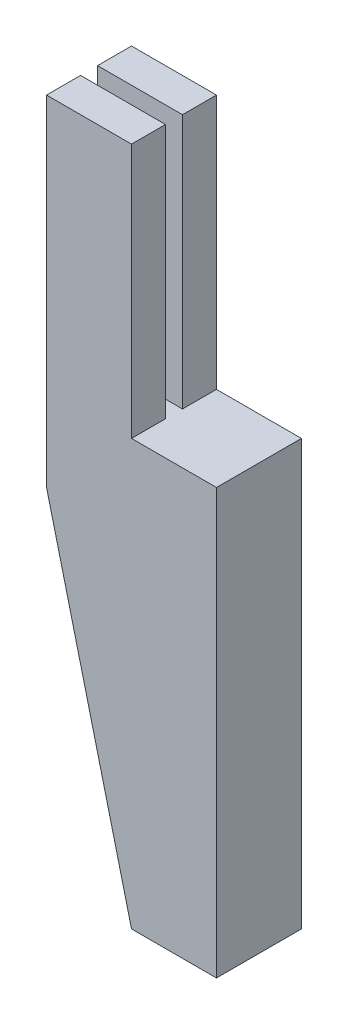
ISO-10303-21;
HEADER;
FILE_DESCRIPTION(('STEP AP214'),'2;1');
FILE_NAME('part.step','',(''),(''),'','','');
FILE_SCHEMA(('AUTOMOTIVE_DESIGN { 1 0 10303 214 1 1 1 1 }'));
ENDSEC;
DATA;
#1=APPLICATION_CONTEXT('core data for automotive mechanical design processes');
#2=APPLICATION_PROTOCOL_DEFINITION('international standard','automotive_design',2000,#1);
#3=PRODUCT_CONTEXT('',#1,'mechanical');
#4=PRODUCT('Part','Part','',(#3));
#5=PRODUCT_RELATED_PRODUCT_CATEGORY('part','',(#4));
#6=PRODUCT_DEFINITION_FORMATION('','',#4);
#7=PRODUCT_DEFINITION_CONTEXT('part definition',#1,'design');
#8=PRODUCT_DEFINITION('design','',#6,#7);
#9=PRODUCT_DEFINITION_SHAPE('','',#8);
#10=(LENGTH_UNIT() NAMED_UNIT(*) SI_UNIT(.MILLI.,.METRE.));
#11=(NAMED_UNIT(*) PLANE_ANGLE_UNIT() SI_UNIT($,.RADIAN.));
#12=(NAMED_UNIT(*) SI_UNIT($,.STERADIAN.) SOLID_ANGLE_UNIT());
#13=UNCERTAINTY_MEASURE_WITH_UNIT(LENGTH_MEASURE(1.E-05),#10,'distance_accuracy_value','');
#14=(GEOMETRIC_REPRESENTATION_CONTEXT(3) GLOBAL_UNCERTAINTY_ASSIGNED_CONTEXT((#13)) GLOBAL_UNIT_ASSIGNED_CONTEXT((#10,
#11,#12)) REPRESENTATION_CONTEXT('',''));
#15=CARTESIAN_POINT('',(0.,0.,0.));
#16=DIRECTION('',(0.,0.,1.));
#17=DIRECTION('',(1.,0.,0.));
#18=AXIS2_PLACEMENT_3D('',#15,#16,#17);
#19=CARTESIAN_POINT('',(0.,0.,10.));
#20=DIRECTION('',(-1.,0.,0.));
#21=DIRECTION('',(0.,0.,1.));
#22=AXIS2_PLACEMENT_3D('',#19,#20,#21);
#23=PLANE('',#22);
#24=DIRECTION('',(0.,0.,-1.));
#25=VECTOR('',#24,1.);
#26=CARTESIAN_POINT('',(0.,30.,10.));
#27=LINE('',#26,#25);
#28=CARTESIAN_POINT('',(0.,30.,4.));
#29=VERTEX_POINT('',#28);
#30=CARTESIAN_POINT('',(0.,30.,0.));
#31=VERTEX_POINT('',#30);
#32=EDGE_CURVE('E159',#29,#31,#27,.T.);
#33=ORIENTED_EDGE('',*,*,#32,.F.);
#34=DIRECTION('',(0.,1.,0.));
#35=VECTOR('',#34,1.);
#36=CARTESIAN_POINT('',(0.,0.,4.));
#37=LINE('',#36,#35);
#38=CARTESIAN_POINT('',(0.,0.,4.));
#39=VERTEX_POINT('',#38);
#40=EDGE_CURVE('E192',#39,#29,#37,.T.);
#41=ORIENTED_EDGE('',*,*,#40,.F.);
#42=DIRECTION('',(0.,0.,-1.));
#43=VECTOR('',#42,1.);
#44=CARTESIAN_POINT('',(0.,0.,10.));
#45=LINE('',#44,#43);
#46=CARTESIAN_POINT('',(0.,0.,0.));
#47=VERTEX_POINT('',#46);
#48=EDGE_CURVE('E41',#39,#47,#45,.T.);
#49=ORIENTED_EDGE('',*,*,#48,.T.);
#50=DIRECTION('',(0.,1.,0.));
#51=VECTOR('',#50,1.);
#52=CARTESIAN_POINT('',(0.,0.,0.));
#53=LINE('',#52,#51);
#54=EDGE_CURVE('E139',#47,#31,#53,.T.);
#55=ORIENTED_EDGE('',*,*,#54,.T.);
#56=EDGE_LOOP('',(#33,#41,#49,#55));
#57=FACE_BOUND('',#56,.T.);
#58=ADVANCED_FACE('F33',(#57),#23,.F.);
#59=CARTESIAN_POINT('',(0.,30.,10.));
#60=DIRECTION('',(0.,-1.,0.));
#61=DIRECTION('',(0.,0.,-1.));
#62=AXIS2_PLACEMENT_3D('',#59,#60,#61);
#63=PLANE('',#62);
#64=DIRECTION('',(0.,0.,-1.));
#65=VECTOR('',#64,1.);
#66=CARTESIAN_POINT('',(-10.,30.,10.));
#67=LINE('',#66,#65);
#68=CARTESIAN_POINT('',(-10.,30.,4.));
#69=VERTEX_POINT('',#68);
#70=CARTESIAN_POINT('',(-10.,30.,0.));
#71=VERTEX_POINT('',#70);
#72=EDGE_CURVE('E156',#69,#71,#67,.T.);
#73=ORIENTED_EDGE('',*,*,#72,.F.);
#74=DIRECTION('',(-1.,0.,0.));
#75=VECTOR('',#74,1.);
#76=CARTESIAN_POINT('',(-10.,30.,4.));
#77=LINE('',#76,#75);
#78=EDGE_CURVE('E175',#29,#69,#77,.T.);
#79=ORIENTED_EDGE('',*,*,#78,.F.);
#80=ORIENTED_EDGE('',*,*,#32,.T.);
#81=DIRECTION('',(-1.,0.,0.));
#82=VECTOR('',#81,1.);
#83=CARTESIAN_POINT('',(0.,30.,0.));
#84=LINE('',#83,#82);
#85=EDGE_CURVE('E143',#31,#71,#84,.T.);
#86=ORIENTED_EDGE('',*,*,#85,.T.);
#87=EDGE_LOOP('',(#73,#79,#80,#86));
#88=FACE_BOUND('',#87,.T.);
#89=ADVANCED_FACE('F170',(#88),#63,.F.);
#90=CARTESIAN_POINT('',(10.,0.,10.));
#91=DIRECTION('',(0.,-1.,0.));
#92=DIRECTION('',(1.,0.,0.));
#93=AXIS2_PLACEMENT_3D('',#90,#91,#92);
#94=PLANE('',#93);
#95=DIRECTION('',(-1.,0.,0.));
#96=VECTOR('',#95,1.);
#97=CARTESIAN_POINT('',(10.,0.,0.));
#98=LINE('',#97,#96);
#99=CARTESIAN_POINT('',(10.,0.,0.));
#100=VERTEX_POINT('',#99);
#101=EDGE_CURVE('E136',#100,#47,#98,.T.);
#102=ORIENTED_EDGE('',*,*,#101,.T.);
#103=ORIENTED_EDGE('',*,*,#48,.F.);
#104=DIRECTION('',(-1.,0.,0.));
#105=VECTOR('',#104,1.);
#106=CARTESIAN_POINT('',(-10.,0.,4.));
#107=LINE('',#106,#105);
#108=CARTESIAN_POINT('',(-10.,0.,4.));
#109=VERTEX_POINT('',#108);
#110=EDGE_CURVE('E48',#39,#109,#107,.T.);
#111=ORIENTED_EDGE('',*,*,#110,.T.);
#112=DIRECTION('',(0.,0.,1.));
#113=VECTOR('',#112,1.);
#114=CARTESIAN_POINT('',(-10.,0.,4.));
#115=LINE('',#114,#113);
#116=CARTESIAN_POINT('',(-10.,0.,6.));
#117=VERTEX_POINT('',#116);
#118=EDGE_CURVE('E212',#109,#117,#115,.T.);
#119=ORIENTED_EDGE('',*,*,#118,.T.);
#120=DIRECTION('',(1.,0.,0.));
#121=VECTOR('',#120,1.);
#122=CARTESIAN_POINT('',(-10.,0.,6.));
#123=LINE('',#122,#121);
#124=CARTESIAN_POINT('',(0.,0.,6.));
#125=VERTEX_POINT('',#124);
#126=EDGE_CURVE('E206',#117,#125,#123,.T.);
#127=ORIENTED_EDGE('',*,*,#126,.T.);
#128=CARTESIAN_POINT('',(0.,0.,10.));
#129=VERTEX_POINT('',#128);
#130=EDGE_CURVE('E11',#129,#125,#45,.T.);
#131=ORIENTED_EDGE('',*,*,#130,.F.);
#132=DIRECTION('',(-1.,0.,0.));
#133=VECTOR('',#132,1.);
#134=CARTESIAN_POINT('',(10.,0.,10.));
#135=LINE('',#134,#133);
#136=CARTESIAN_POINT('',(10.,0.,10.));
#137=VERTEX_POINT('',#136);
#138=EDGE_CURVE('E152',#137,#129,#135,.T.);
#139=ORIENTED_EDGE('',*,*,#138,.F.);
#140=DIRECTION('',(0.,0.,-1.));
#141=VECTOR('',#140,1.);
#142=CARTESIAN_POINT('',(10.,0.,10.));
#143=LINE('',#142,#141);
#144=EDGE_CURVE('E132',#137,#100,#143,.T.);
#145=ORIENTED_EDGE('',*,*,#144,.T.);
#146=EDGE_LOOP('',(#102,#103,#111,#119,#127,#131,#139,#145));
#147=FACE_BOUND('',#146,.T.);
#148=ADVANCED_FACE('F35',(#147),#94,.F.);
#149=ORIENTED_EDGE('',*,*,#130,.T.);
#150=DIRECTION('',(0.,1.,0.));
#151=VECTOR('',#150,1.);
#152=CARTESIAN_POINT('',(0.,0.,6.));
#153=LINE('',#152,#151);
#154=CARTESIAN_POINT('',(0.,30.,6.));
#155=VERTEX_POINT('',#154);
#156=EDGE_CURVE('E203',#125,#155,#153,.T.);
#157=ORIENTED_EDGE('',*,*,#156,.T.);
#158=CARTESIAN_POINT('',(0.,30.,10.));
#159=VERTEX_POINT('',#158);
#160=EDGE_CURVE('E160',#159,#155,#27,.T.);
#161=ORIENTED_EDGE('',*,*,#160,.F.);
#162=DIRECTION('',(0.,1.,0.));
#163=VECTOR('',#162,1.);
#164=CARTESIAN_POINT('',(0.,0.,10.));
#165=LINE('',#164,#163);
#166=EDGE_CURVE('E95',#129,#159,#165,.T.);
#167=ORIENTED_EDGE('',*,*,#166,.F.);
#168=EDGE_LOOP('',(#149,#157,#161,#167));
#169=FACE_BOUND('',#168,.T.);
#170=ADVANCED_FACE('F215',(#169),#23,.F.);
#171=ORIENTED_EDGE('',*,*,#160,.T.);
#172=DIRECTION('',(1.,0.,0.));
#173=VECTOR('',#172,1.);
#174=CARTESIAN_POINT('',(-10.,30.,6.));
#175=LINE('',#174,#173);
#176=CARTESIAN_POINT('',(-10.,30.,6.));
#177=VERTEX_POINT('',#176);
#178=EDGE_CURVE('E207',#177,#155,#175,.T.);
#179=ORIENTED_EDGE('',*,*,#178,.F.);
#180=CARTESIAN_POINT('',(-10.,30.,10.));
#181=VERTEX_POINT('',#180);
#182=EDGE_CURVE('E157',#181,#177,#67,.T.);
#183=ORIENTED_EDGE('',*,*,#182,.F.);
#184=DIRECTION('',(-1.,0.,0.));
#185=VECTOR('',#184,1.);
#186=CARTESIAN_POINT('',(0.,30.,10.));
#187=LINE('',#186,#185);
#188=EDGE_CURVE('E332',#159,#181,#187,.T.);
#189=ORIENTED_EDGE('',*,*,#188,.F.);
#190=EDGE_LOOP('',(#171,#179,#183,#189));
#191=FACE_BOUND('',#190,.T.);
#192=ADVANCED_FACE('F217',(#191),#63,.F.);
#193=CARTESIAN_POINT('',(-10.,30.,10.));
#194=DIRECTION('',(1.,0.,0.));
#195=DIRECTION('',(0.,1.,0.));
#196=AXIS2_PLACEMENT_3D('',#193,#194,#195);
#197=PLANE('',#196);
#198=ORIENTED_EDGE('',*,*,#118,.F.);
#199=DIRECTION('',(0.,1.,0.));
#200=VECTOR('',#199,1.);
#201=CARTESIAN_POINT('',(-10.,0.,4.));
#202=LINE('',#201,#200);
#203=EDGE_CURVE('E140',#109,#69,#202,.T.);
#204=ORIENTED_EDGE('',*,*,#203,.T.);
#205=ORIENTED_EDGE('',*,*,#72,.T.);
#206=DIRECTION('',(0.,-1.,0.));
#207=VECTOR('',#206,1.);
#208=CARTESIAN_POINT('',(-10.,30.,0.));
#209=LINE('',#208,#207);
#210=CARTESIAN_POINT('',(-9.99999999999999,-10.,0.));
#211=VERTEX_POINT('',#210);
#212=EDGE_CURVE('E146',#71,#211,#209,.T.);
#213=ORIENTED_EDGE('',*,*,#212,.T.);
#214=DIRECTION('',(0.,0.,-1.));
#215=VECTOR('',#214,1.);
#216=CARTESIAN_POINT('',(-9.99999999999999,-10.,10.));
#217=LINE('',#216,#215);
#218=CARTESIAN_POINT('',(-9.99999999999999,-10.,10.));
#219=VERTEX_POINT('',#218);
#220=EDGE_CURVE('E127',#219,#211,#217,.T.);
#221=ORIENTED_EDGE('',*,*,#220,.F.);
#222=DIRECTION('',(0.,-1.,0.));
#223=VECTOR('',#222,1.);
#224=CARTESIAN_POINT('',(-10.,30.,10.));
#225=LINE('',#224,#223);
#226=EDGE_CURVE('E115',#181,#219,#225,.T.);
#227=ORIENTED_EDGE('',*,*,#226,.F.);
#228=ORIENTED_EDGE('',*,*,#182,.T.);
#229=DIRECTION('',(0.,1.,0.));
#230=VECTOR('',#229,1.);
#231=CARTESIAN_POINT('',(-10.,0.,6.));
#232=LINE('',#231,#230);
#233=EDGE_CURVE('E208',#117,#177,#232,.T.);
#234=ORIENTED_EDGE('',*,*,#233,.F.);
#235=EDGE_LOOP('',(#198,#204,#205,#213,#221,#227,#228,#234));
#236=FACE_BOUND('',#235,.T.);
#237=ADVANCED_FACE('F184',(#236),#197,.F.);
#238=CARTESIAN_POINT('',(-9.99999999999999,-10.,10.));
#239=DIRECTION('',(0.970142500145332,0.242535625036333,0.));
#240=DIRECTION('',(-0.242535625036333,0.970142500145332,0.));
#241=AXIS2_PLACEMENT_3D('',#238,#239,#240);
#242=PLANE('',#241);
#243=DIRECTION('',(0.242535625036333,-0.970142500145332,0.));
#244=VECTOR('',#243,1.);
#245=CARTESIAN_POINT('',(-9.99999999999999,-10.,0.));
#246=LINE('',#245,#244);
#247=CARTESIAN_POINT('',(0.,-50.,0.));
#248=VERTEX_POINT('',#247);
#249=EDGE_CURVE('E124',#211,#248,#246,.T.);
#250=ORIENTED_EDGE('',*,*,#249,.T.);
#251=DIRECTION('',(0.,0.,-1.));
#252=VECTOR('',#251,1.);
#253=CARTESIAN_POINT('',(0.,-50.,10.));
#254=LINE('',#253,#252);
#255=CARTESIAN_POINT('',(0.,-50.,10.));
#256=VERTEX_POINT('',#255);
#257=EDGE_CURVE('E121',#256,#248,#254,.T.);
#258=ORIENTED_EDGE('',*,*,#257,.F.);
#259=DIRECTION('',(0.242535625036333,-0.970142500145332,0.));
#260=VECTOR('',#259,1.);
#261=CARTESIAN_POINT('',(-9.99999999999999,-10.,10.));
#262=LINE('',#261,#260);
#263=EDGE_CURVE('E108',#219,#256,#262,.T.);
#264=ORIENTED_EDGE('',*,*,#263,.F.);
#265=ORIENTED_EDGE('',*,*,#220,.T.);
#266=EDGE_LOOP('',(#250,#258,#264,#265));
#267=FACE_BOUND('',#266,.T.);
#268=ADVANCED_FACE('F122',(#267),#242,.F.);
#269=CARTESIAN_POINT('',(0.,-50.,10.));
#270=DIRECTION('',(0.,1.,0.));
#271=DIRECTION('',(0.,0.,1.));
#272=AXIS2_PLACEMENT_3D('',#269,#270,#271);
#273=PLANE('',#272);
#274=DIRECTION('',(1.,0.,0.));
#275=VECTOR('',#274,1.);
#276=CARTESIAN_POINT('',(0.,-50.,0.));
#277=LINE('',#276,#275);
#278=CARTESIAN_POINT('',(10.,-50.,0.));
#279=VERTEX_POINT('',#278);
#280=EDGE_CURVE('E149',#248,#279,#277,.T.);
#281=ORIENTED_EDGE('',*,*,#280,.T.);
#282=DIRECTION('',(0.,0.,-1.));
#283=VECTOR('',#282,1.);
#284=CARTESIAN_POINT('',(10.,-50.,10.));
#285=LINE('',#284,#283);
#286=CARTESIAN_POINT('',(10.,-50.,10.));
#287=VERTEX_POINT('',#286);
#288=EDGE_CURVE('E128',#287,#279,#285,.T.);
#289=ORIENTED_EDGE('',*,*,#288,.F.);
#290=DIRECTION('',(1.,0.,0.));
#291=VECTOR('',#290,1.);
#292=CARTESIAN_POINT('',(0.,-50.,10.));
#293=LINE('',#292,#291);
#294=EDGE_CURVE('E112',#256,#287,#293,.T.);
#295=ORIENTED_EDGE('',*,*,#294,.F.);
#296=ORIENTED_EDGE('',*,*,#257,.T.);
#297=EDGE_LOOP('',(#281,#289,#295,#296));
#298=FACE_BOUND('',#297,.T.);
#299=ADVANCED_FACE('F130',(#298),#273,.F.);
#300=CARTESIAN_POINT('',(10.,-50.,10.));
#301=DIRECTION('',(-1.,0.,0.));
#302=DIRECTION('',(0.,0.,1.));
#303=AXIS2_PLACEMENT_3D('',#300,#301,#302);
#304=PLANE('',#303);
#305=DIRECTION('',(0.,1.,0.));
#306=VECTOR('',#305,1.);
#307=CARTESIAN_POINT('',(10.,-50.,0.));
#308=LINE('',#307,#306);
#309=EDGE_CURVE('E87',#279,#100,#308,.T.);
#310=ORIENTED_EDGE('',*,*,#309,.T.);
#311=ORIENTED_EDGE('',*,*,#144,.F.);
#312=DIRECTION('',(0.,1.,0.));
#313=VECTOR('',#312,1.);
#314=CARTESIAN_POINT('',(10.,-50.,10.));
#315=LINE('',#314,#313);
#316=EDGE_CURVE('E57',#287,#137,#315,.T.);
#317=ORIENTED_EDGE('',*,*,#316,.F.);
#318=ORIENTED_EDGE('',*,*,#288,.T.);
#319=EDGE_LOOP('',(#310,#311,#317,#318));
#320=FACE_BOUND('',#319,.T.);
#321=ADVANCED_FACE('F236',(#320),#304,.F.);
#322=CARTESIAN_POINT('',(0.,0.,10.));
#323=DIRECTION('',(0.,0.,-1.));
#324=DIRECTION('',(-1.,0.,0.));
#325=AXIS2_PLACEMENT_3D('',#322,#323,#324);
#326=PLANE('',#325);
#327=ORIENTED_EDGE('',*,*,#138,.T.);
#328=ORIENTED_EDGE('',*,*,#166,.T.);
#329=ORIENTED_EDGE('',*,*,#188,.T.);
#330=ORIENTED_EDGE('',*,*,#226,.T.);
#331=ORIENTED_EDGE('',*,*,#263,.T.);
#332=ORIENTED_EDGE('',*,*,#294,.T.);
#333=ORIENTED_EDGE('',*,*,#316,.T.);
#334=EDGE_LOOP('',(#327,#328,#329,#330,#331,#332,#333));
#335=FACE_BOUND('',#334,.T.);
#336=ADVANCED_FACE('F110',(#335),#326,.F.);
#337=CARTESIAN_POINT('',(0.,0.,0.));
#338=DIRECTION('',(0.,0.,-1.));
#339=DIRECTION('',(-1.,0.,0.));
#340=AXIS2_PLACEMENT_3D('',#337,#338,#339);
#341=PLANE('',#340);
#342=ORIENTED_EDGE('',*,*,#101,.F.);
#343=ORIENTED_EDGE('',*,*,#309,.F.);
#344=ORIENTED_EDGE('',*,*,#280,.F.);
#345=ORIENTED_EDGE('',*,*,#249,.F.);
#346=ORIENTED_EDGE('',*,*,#212,.F.);
#347=ORIENTED_EDGE('',*,*,#85,.F.);
#348=ORIENTED_EDGE('',*,*,#54,.F.);
#349=EDGE_LOOP('',(#342,#343,#344,#345,#346,#347,#348));
#350=FACE_BOUND('',#349,.T.);
#351=ADVANCED_FACE('F181',(#350),#341,.T.);
#352=CARTESIAN_POINT('',(-10.,0.,4.));
#353=DIRECTION('',(0.,0.,-1.));
#354=DIRECTION('',(-1.,0.,0.));
#355=AXIS2_PLACEMENT_3D('',#352,#353,#354);
#356=PLANE('',#355);
#357=ORIENTED_EDGE('',*,*,#78,.T.);
#358=ORIENTED_EDGE('',*,*,#203,.F.);
#359=ORIENTED_EDGE('',*,*,#110,.F.);
#360=ORIENTED_EDGE('',*,*,#40,.T.);
#361=EDGE_LOOP('',(#357,#358,#359,#360));
#362=FACE_BOUND('',#361,.T.);
#363=ADVANCED_FACE('F241',(#362),#356,.F.);
#364=CARTESIAN_POINT('',(-10.,0.,6.));
#365=DIRECTION('',(0.,0.,1.));
#366=DIRECTION('',(1.,0.,0.));
#367=AXIS2_PLACEMENT_3D('',#364,#365,#366);
#368=PLANE('',#367);
#369=ORIENTED_EDGE('',*,*,#178,.T.);
#370=ORIENTED_EDGE('',*,*,#156,.F.);
#371=ORIENTED_EDGE('',*,*,#126,.F.);
#372=ORIENTED_EDGE('',*,*,#233,.T.);
#373=EDGE_LOOP('',(#369,#370,#371,#372));
#374=FACE_BOUND('',#373,.T.);
#375=ADVANCED_FACE('F205',(#374),#368,.F.);
#376=CLOSED_SHELL('',(#58,#89,#148,#170,#192,#237,#268,#299,#321,#336,#351,#363,#375));
#377=MANIFOLD_SOLID_BREP('B2',#376);
#378=ADVANCED_BREP_SHAPE_REPRESENTATION('',(#18,#377),#14);
#379=SHAPE_DEFINITION_REPRESENTATION(#9,#378);
ENDSEC;
END-ISO-10303-21;
